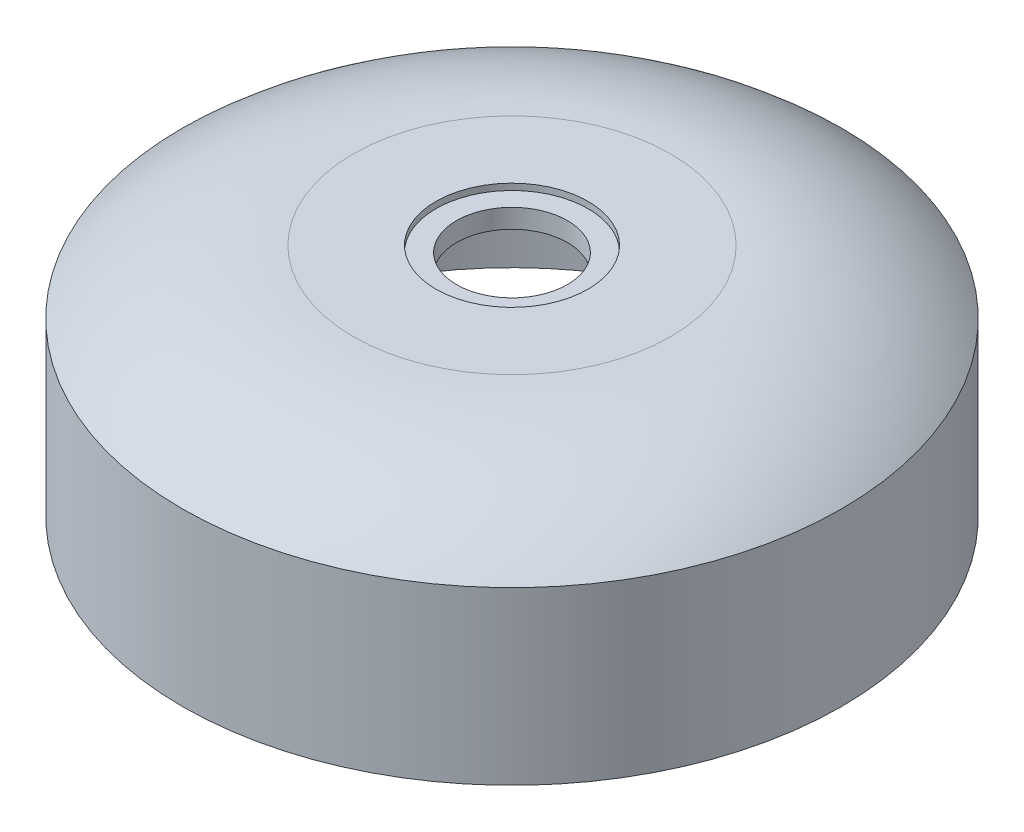
ISO-10303-21;
HEADER;
FILE_DESCRIPTION(('STEP AP214'),'2;1');
FILE_NAME('part.step','',(''),(''),'','','');
FILE_SCHEMA(('AUTOMOTIVE_DESIGN { 1 0 10303 214 1 1 1 1 }'));
ENDSEC;
DATA;
#1=APPLICATION_CONTEXT('core data for automotive mechanical design processes');
#2=APPLICATION_PROTOCOL_DEFINITION('international standard','automotive_design',2000,#1);
#3=PRODUCT_CONTEXT('',#1,'mechanical');
#4=PRODUCT('Part','Part','',(#3));
#5=PRODUCT_RELATED_PRODUCT_CATEGORY('part','',(#4));
#6=PRODUCT_DEFINITION_FORMATION('','',#4);
#7=PRODUCT_DEFINITION_CONTEXT('part definition',#1,'design');
#8=PRODUCT_DEFINITION('design','',#6,#7);
#9=PRODUCT_DEFINITION_SHAPE('','',#8);
#10=(LENGTH_UNIT() NAMED_UNIT(*) SI_UNIT(.MILLI.,.METRE.));
#11=(NAMED_UNIT(*) PLANE_ANGLE_UNIT() SI_UNIT($,.RADIAN.));
#12=(NAMED_UNIT(*) SI_UNIT($,.STERADIAN.) SOLID_ANGLE_UNIT());
#13=UNCERTAINTY_MEASURE_WITH_UNIT(LENGTH_MEASURE(1.E-05),#10,'distance_accuracy_value','');
#14=(GEOMETRIC_REPRESENTATION_CONTEXT(3) GLOBAL_UNCERTAINTY_ASSIGNED_CONTEXT((#13)) GLOBAL_UNIT_ASSIGNED_CONTEXT((#10,
#11,#12)) REPRESENTATION_CONTEXT('',''));
#15=CARTESIAN_POINT('',(0.,0.,0.));
#16=DIRECTION('',(0.,0.,1.));
#17=DIRECTION('',(1.,0.,0.));
#18=AXIS2_PLACEMENT_3D('',#15,#16,#17);
#19=CARTESIAN_POINT('',(0.,1.,0.));
#20=DIRECTION('',(0.,1.,0.));
#21=DIRECTION('',(0.,0.,1.));
#22=AXIS2_PLACEMENT_3D('',#19,#20,#21);
#23=CYLINDRICAL_SURFACE('',#22,4.375);
#24=CARTESIAN_POINT('',(0.,3.,0.));
#25=DIRECTION('',(0.,1.,0.));
#26=DIRECTION('',(0.,0.,1.));
#27=AXIS2_PLACEMENT_3D('',#24,#25,#26);
#28=CIRCLE('',#27,4.375);
#29=CARTESIAN_POINT('',(0.,3.,4.375));
#30=VERTEX_POINT('',#29);
#31=EDGE_CURVE('E82',#30,#30,#28,.T.);
#32=ORIENTED_EDGE('',*,*,#31,.F.);
#33=EDGE_LOOP('',(#32));
#34=FACE_BOUND('',#33,.T.);
#35=CARTESIAN_POINT('',(0.,4.5,0.));
#36=DIRECTION('',(0.,1.,0.));
#37=DIRECTION('',(0.,0.,1.));
#38=AXIS2_PLACEMENT_3D('',#35,#36,#37);
#39=CIRCLE('',#38,4.375);
#40=CARTESIAN_POINT('',(0.,4.5,4.375));
#41=VERTEX_POINT('',#40);
#42=EDGE_CURVE('E45',#41,#41,#39,.F.);
#43=ORIENTED_EDGE('',*,*,#42,.F.);
#44=EDGE_LOOP('',(#43));
#45=FACE_BOUND('',#44,.T.);
#46=ADVANCED_FACE('F41',(#34,#45),#23,.F.);
#47=CARTESIAN_POINT('',(0.,-14.375,0.));
#48=DIRECTION('',(0.,-1.,0.));
#49=DIRECTION('',(0.,0.,-1.));
#50=AXIS2_PLACEMENT_3D('',#47,#48,#49);
#51=DEGENERATE_TOROIDAL_SURFACE('',#50,13.,17.3814505391108,.T.);
#52=CARTESIAN_POINT('',(-2.05943454850463,0.19621219076057,-22.3814512005602));
#53=CARTESIAN_POINT('',(-1.94735802455095,0.134371402028465,-22.487259136886));
#54=CARTESIAN_POINT('',(-1.82607781715217,0.0760668113987537,-22.5854123510526));
#55=CARTESIAN_POINT('',(-1.5667001930387,-0.0307750314765408,-22.7632296226294));
#56=CARTESIAN_POINT('',(-1.42860588928565,-0.0793140873127828,-22.8428970945777));
#57=CARTESIAN_POINT('',(-1.13735307688941,-0.163995941628465,-22.9807414720083));
#58=CARTESIAN_POINT('',(-0.984108771892124,-0.200062244710892,-23.0387859253823));
#59=CARTESIAN_POINT('',(-0.667536386710761,-0.256633700933164,-23.1294086238986));
#60=CARTESIAN_POINT('',(-0.504216128759802,-0.2771507649902,-23.1620063621283));
#61=CARTESIAN_POINT('',(-0.18874234137231,-0.299737880621983,-23.197863384178));
#62=CARTESIAN_POINT('',(-0.0369767801083575,-0.303356576246571,-23.2035859483691));
#63=CARTESIAN_POINT('',(0.265306434128415,-0.296089696747955,-23.1920679422734));
#64=CARTESIAN_POINT('',(0.415824357795731,-0.285207355382269,-23.1748324916657));
#65=CARTESIAN_POINT('',(0.703135402021717,-0.250722352754957,-23.119909992035));
#66=CARTESIAN_POINT('',(0.840233517435311,-0.227822012664228,-23.0833513992038));
#67=CARTESIAN_POINT('',(1.10591546524896,-0.171196871728586,-22.9922546602371));
#68=CARTESIAN_POINT('',(1.23449770550394,-0.137470053596726,-22.9377131633134));
#69=CARTESIAN_POINT('',(1.488980008897,-0.0584024655000056,-22.8085710738749));
#70=CARTESIAN_POINT('',(1.61412479427046,-0.0124355430873811,-22.7328724058282));
#71=CARTESIAN_POINT('',(1.850052038222,0.087564378035964,-22.5660538946529));
#72=CARTESIAN_POINT('',(1.96082780892207,0.141601107744694,-22.4749269157735));
#73=CARTESIAN_POINT('',(2.18078865074186,0.263411592137683,-22.266430460831));
#74=CARTESIAN_POINT('',(2.28770647084811,0.33205405785726,-22.1471773980103));
#75=CARTESIAN_POINT('',(2.48021372326385,0.474330756599312,-21.8952032872505));
#76=CARTESIAN_POINT('',(2.56579116500576,0.547967766496449,-21.7624747264676));
#77=CARTESIAN_POINT('',(2.7245154100547,0.707760837711285,-21.4682633382959));
#78=CARTESIAN_POINT('',(2.79454616565821,0.794289492523027,-21.3052947809788));
#79=CARTESIAN_POINT('',(2.90494041389823,0.967773196104407,-20.9697659508785));
#80=CARTESIAN_POINT('',(2.94529072540192,1.05472841707699,-20.7972014530696));
#81=CARTESIAN_POINT('',(2.99659399584286,1.23159131298276,-20.4359357001578));
#82=CARTESIAN_POINT('',(3.00562878289929,1.32136110894079,-20.2468886943308));
#83=CARTESIAN_POINT('',(2.98759075845205,1.49545525684212,-19.8679454997471));
#84=CARTESIAN_POINT('',(2.96052168762472,1.57978017197386,-19.6780494009953));
#85=CARTESIAN_POINT('',(2.87096254305485,1.73762036636326,-19.3099189029837));
#86=CARTESIAN_POINT('',(2.80968440228521,1.81140243350658,-19.1315068072518));
#87=CARTESIAN_POINT('',(2.65282267436121,1.94921448506181,-18.7863536882708));
#88=CARTESIAN_POINT('',(2.55726022384852,2.01325044348638,-18.6196055495911));
#89=CARTESIAN_POINT('',(2.34327111476732,2.12494495363453,-18.318449484072));
#90=CARTESIAN_POINT('',(2.227508820914,2.17353715626537,-18.1824943904952));
#91=CARTESIAN_POINT('',(1.97166603204633,2.2604728677244,-17.9318398968506));
#92=CARTESIAN_POINT('',(1.83159726850666,2.29882129812124,-17.8171302976452));
#93=CARTESIAN_POINT('',(1.54270253169887,2.36253252168401,-17.6215914447136));
#94=CARTESIAN_POINT('',(1.39532515991023,2.38865447996821,-17.5388642119703));
#95=CARTESIAN_POINT('',(1.087676485898,2.43202482489792,-17.3990205533553));
#96=CARTESIAN_POINT('',(0.927408141189576,2.44927524022269,-17.3418982727153));
#97=CARTESIAN_POINT('',(0.605079399638042,2.47462910884483,-17.2571085676074));
#98=CARTESIAN_POINT('',(0.443313590076823,2.48305245420747,-17.2284132623672));
#99=CARTESIAN_POINT('',(0.117055860294563,2.49202941361278,-17.1978118774118));
#100=CARTESIAN_POINT('',(-0.0474358103289567,2.49258374425057,-17.1959033583469));
#101=CARTESIAN_POINT('',(-0.372506232026529,2.48587250913071,-17.2188103490379));
#102=CARTESIAN_POINT('',(-0.53310819513741,2.47869523691411,-17.2433241226953));
#103=CARTESIAN_POINT('',(-0.847748391868458,2.45653403908781,-17.3177346131452));
#104=CARTESIAN_POINT('',(-1.00178688580412,2.44155042339993,-17.3676303222406));
#105=CARTESIAN_POINT('',(-1.29931446198763,2.40355430494648,-17.4911664972618));
#106=CARTESIAN_POINT('',(-1.44278221964165,2.38052608311388,-17.5648534294461));
#107=CARTESIAN_POINT('',(-1.71500313766852,2.32633385684208,-17.7333437874638));
#108=CARTESIAN_POINT('',(-1.84375594875845,2.29516965934006,-17.8281477143855));
#109=CARTESIAN_POINT('',(-2.08546163967563,2.22418767750594,-18.0374001096801));
#110=CARTESIAN_POINT('',(-2.19810538447062,2.18423053879852,-18.1521578388488));
#111=CARTESIAN_POINT('',(-2.40249249463909,2.09638856910075,-18.3962841437541));
#112=CARTESIAN_POINT('',(-2.49423233626973,2.04850240387069,-18.5256551773463));
#113=CARTESIAN_POINT('',(-2.65886367630612,1.94324202383834,-18.8009672811889));
#114=CARTESIAN_POINT('',(-2.73074235698823,1.88554189323608,-18.9473880967192));
#115=CARTESIAN_POINT('',(-2.84932039444323,1.76342060908691,-19.2474135660646));
#116=CARTESIAN_POINT('',(-2.89601245410286,1.69899751419562,-19.4010202878009));
#117=CARTESIAN_POINT('',(-2.96675077454022,1.55979815518288,-19.7229912200314));
#118=CARTESIAN_POINT('',(-2.98885281023807,1.4846081965046,-19.8916028671859));
#119=CARTESIAN_POINT('',(-3.00460089819919,1.32992694101096,-20.2281960005441));
#120=CARTESIAN_POINT('',(-2.99823284978194,1.25043353203869,-20.3961771332367));
#121=CARTESIAN_POINT('',(-2.95627935267687,1.08253768512971,-20.7413684777178));
#122=CARTESIAN_POINT('',(-2.91832950304052,0.993940902930202,-20.9181985323566));
#123=CARTESIAN_POINT('',(-2.81140119652405,0.816893426334674,-21.2623031139661));
#124=CARTESIAN_POINT('',(-2.74242229516874,0.728442734049534,-21.4295775040182));
#125=CARTESIAN_POINT('',(-2.58249639919445,0.562869703631484,-21.7354758480389));
#126=CARTESIAN_POINT('',(-2.49417553933646,0.485456863261925,-21.8753184670147));
#127=CARTESIAN_POINT('',(-2.29405770102501,0.336019463192258,-22.1403173647928));
#128=CARTESIAN_POINT('',(-2.18227427802276,0.26399182464875,-22.265482058936));
#129=CARTESIAN_POINT('',(-2.05943454850463,0.19621219076057,-22.3814512005602));
#130=B_SPLINE_CURVE_WITH_KNOTS('',3,(#52,#53,#54,#55,#56,#57,#58,#59,#60,#61,#62,#63,#64,#65,
#66,#67,#68,#69,#70,#71,#72,#73,#74,#75,#76,#77,#78,#79,#80,#81,#82,#83,#84,#85,#86,#87,#88,#89,
#90,#91,#92,#93,#94,#95,#96,#97,#98,#99,#100,#101,#102,#103,#104,#105,#106,#107,#108,#109,#110,
#111,#112,#113,#114,#115,#116,#117,#118,#119,#120,#121,#122,#123,#124,#125,#126,#127,#128,#129),
.UNSPECIFIED.,.T.,.F.,(4,2,2,2,2,2,2,2,2,2,2,2,2,2,2,2,2,2,2,2,2,2,2,2,2,2,2,2,2,2,2,2,2,2,2,2,
2,2,4),(0.,0.497710027984592,0.995328049653929,1.4959459812602,1.99618004440372,
2.44953215716146,2.90278318849392,3.33209112594184,3.76147910239058,4.21960082365987,
4.67793501263565,5.19863164635652,5.71962018921495,6.30914246619929,6.89892639316561,
7.52425353372941,8.14951588994966,8.75391674904872,9.35794562711023,9.91016237702276,
10.462113338048,10.9725952638964,11.4829604045261,11.9741127819841,12.4652204321594,
12.9507785977008,13.4363174874316,13.9228104707696,14.4093149994037,14.9041702300864,
15.39910881624,15.9159327629764,16.4329063645656,16.9883588778663,17.5440865264929,
18.1456085933221,18.7471392769198,19.2929610895799,19.8384684184953),.UNSPECIFIED.);
#131=CARTESIAN_POINT('',(-2.05943454850463,0.19621219076057,-22.3814512005602));
#132=VERTEX_POINT('',#131);
#133=EDGE_CURVE('E12',#132,#132,#130,.T.);
#134=ORIENTED_EDGE('',*,*,#133,.F.);
#135=EDGE_LOOP('',(#134));
#136=FACE_BOUND('',#135,.T.);
#137=CARTESIAN_POINT('',(-2.18650556302163,2.18598092765139,18.1459324687646));
#138=CARTESIAN_POINT('',(-2.07652155186065,2.22721474772232,18.0288536583107));
#139=CARTESIAN_POINT('',(-1.95638686679738,2.26435252353792,17.9198722602093));
#140=CARTESIAN_POINT('',(-1.69859506310718,2.3301668569554,17.7218605031923));
#141=CARTESIAN_POINT('',(-1.56093935609993,2.35884409558218,17.6328285386002));
#142=CARTESIAN_POINT('',(-1.27159696480963,2.4077631425832,17.4778673456709));
#143=CARTESIAN_POINT('',(-1.11989474504464,2.42799547135195,17.4119640929792));
#144=CARTESIAN_POINT('',(-0.806913604333441,2.4601508504309,17.3058347855593));
#145=CARTESIAN_POINT('',(-0.645634643129822,2.47207386580887,17.2656088387781));
#146=CARTESIAN_POINT('',(-0.321213512030281,2.48765509539738,17.2128024117915));
#147=CARTESIAN_POINT('',(-0.158156834236946,2.49145790615691,17.1997383721957));
#148=CARTESIAN_POINT('',(0.167902079683214,2.49130265784383,17.2002695419155));
#149=CARTESIAN_POINT('',(0.33090431883806,2.48734514597147,17.2138628715517));
#150=CARTESIAN_POINT('',(0.651110490956552,2.4716469669185,17.2670453028741));
#151=CARTESIAN_POINT('',(0.808345547406439,2.45995774440934,17.3064625628538));
#152=CARTESIAN_POINT('',(1.11372758532192,2.42867433341333,17.4097328247002));
#153=CARTESIAN_POINT('',(1.26187483152552,2.40908037532632,17.4735851143548));
#154=CARTESIAN_POINT('',(1.54584131695074,2.36169625092298,17.6238937113218));
#155=CARTESIAN_POINT('',(1.6815881951544,2.33386155499789,17.7104725277018));
#156=CARTESIAN_POINT('',(1.93634415520972,2.27002858101927,17.9030292210182));
#157=CARTESIAN_POINT('',(2.05535225466156,2.23402982414021,18.0090082357139));
#158=CARTESIAN_POINT('',(2.27653212918197,2.15316918332024,18.2395110963654));
#159=CARTESIAN_POINT('',(2.37823671523676,2.10811704259135,18.3644157223966));
#160=CARTESIAN_POINT('',(2.55934156156526,2.01032603652422,18.6267251179778));
#161=CARTESIAN_POINT('',(2.63873709389588,1.95758554539048,18.764132529079));
#162=CARTESIAN_POINT('',(2.77782332531247,1.84232092232306,19.0549870416486));
#163=CARTESIAN_POINT('',(2.83622982757297,1.77942392062865,19.2088991006982));
#164=CARTESIAN_POINT('',(2.92684769921113,1.64746780646242,19.5216885953488));
#165=CARTESIAN_POINT('',(2.95905005905916,1.57840658365171,19.6805677192503));
#166=CARTESIAN_POINT('',(2.99913625639042,1.42992711011542,20.0121970898368));
#167=CARTESIAN_POINT('',(3.00485698683416,1.35012257046619,20.185035658961));
#168=CARTESIAN_POINT('',(2.98699066546943,1.18724799140196,20.527633070414));
#169=CARTESIAN_POINT('',(2.96339237904031,1.10417671203396,20.6973907068784));
#170=CARTESIAN_POINT('',(2.8850584052613,0.93068488624068,21.0426804800124));
#171=CARTESIAN_POINT('',(2.82809203292023,0.840185719897724,21.2176705614218));
#172=CARTESIAN_POINT('',(2.6827135313461,0.661122729990272,21.555306904538));
#173=CARTESIAN_POINT('',(2.59428255213644,0.572560100408544,21.7179456957441));
#174=CARTESIAN_POINT('',(2.38553105778214,0.399498775479485,22.0289135869299));
#175=CARTESIAN_POINT('',(2.26468391906006,0.315097238791356,22.1769454836319));
#176=CARTESIAN_POINT('',(1.99370497115634,0.15659842166393,22.4498883594876));
#177=CARTESIAN_POINT('',(1.843614519448,0.0824868392058568,22.5748315113507));
#178=CARTESIAN_POINT('',(1.55566610238256,-0.0346325554224723,22.7695603001602));
#179=CARTESIAN_POINT('',(1.42319967838931,-0.0808583750087976,22.8454093303416));
#180=CARTESIAN_POINT('',(1.14533906186134,-0.161701361488117,22.9770079174705));
#181=CARTESIAN_POINT('',(0.999954276574715,-0.196326889555612,23.0327719533217));
#182=CARTESIAN_POINT('',(0.698993928526707,-0.251784870257744,23.1216676825622));
#183=CARTESIAN_POINT('',(0.543369604811525,-0.272545151347659,23.154680981453));
#184=CARTESIAN_POINT('',(0.227570308663605,-0.298295204454274,23.1955838594945));
#185=CARTESIAN_POINT('',(0.0673971755734813,-0.303291261751296,23.2034834516238));
#186=CARTESIAN_POINT('',(-0.237269695523354,-0.297390238503471,23.194128347824));
#187=CARTESIAN_POINT('',(-0.381866131068071,-0.287895535340386,23.1790932777122));
#188=CARTESIAN_POINT('',(-0.666005025927889,-0.256229119784772,23.1286953135262));
#189=CARTESIAN_POINT('',(-0.805547486313048,-0.234057410076313,23.0933324237558));
#190=CARTESIAN_POINT('',(-1.07672662914256,-0.178334065783628,23.0037760306381));
#191=CARTESIAN_POINT('',(-1.20832340917858,-0.144729844315317,22.9494954817917));
#192=CARTESIAN_POINT('',(-1.46034613530934,-0.0680244086963659,22.8243488475233));
#193=CARTESIAN_POINT('',(-1.58076842371432,-0.0249201004036093,22.7534773580265));
#194=CARTESIAN_POINT('',(-1.82094309718966,0.0738861467551388,22.5890502284351));
#195=CARTESIAN_POINT('',(-1.93923075168874,0.130444342797984,22.4938747465265));
#196=CARTESIAN_POINT('',(-2.15843978929303,0.250334306774168,22.2889435441133));
#197=CARTESIAN_POINT('',(-2.25935184190481,0.313669684560363,22.1791800457202));
#198=CARTESIAN_POINT('',(-2.45597629753219,0.454320957574133,21.9310929292444));
#199=CARTESIAN_POINT('',(-2.54887033321121,0.532339548787458,21.790930715773));
#200=CARTESIAN_POINT('',(-2.7095706439826,0.691490301188505,21.4984980373521));
#201=CARTESIAN_POINT('',(-2.77736350441147,0.772624101729627,21.3462211506903));
#202=CARTESIAN_POINT('',(-2.89262358065283,0.944111633222532,21.0163150116762));
#203=CARTESIAN_POINT('',(-2.93719923012889,1.03453669884453,20.8377045340389));
#204=CARTESIAN_POINT('',(-2.99309956035577,1.21316251843519,20.4741925324518));
#205=CARTESIAN_POINT('',(-3.00441390475264,1.30136257251429,20.2892890709351));
#206=CARTESIAN_POINT('',(-2.9924016707668,1.47414077292392,19.9152337156885));
#207=CARTESIAN_POINT('',(-2.96851973248239,1.55863871908919,19.7260610974251));
#208=CARTESIAN_POINT('',(-2.88417317780174,1.71975587809751,19.352581342228));
#209=CARTESIAN_POINT('',(-2.82373569492453,1.79638088536243,19.1682707022608));
#210=CARTESIAN_POINT('',(-2.67783635078707,1.92913115820879,18.8372603089365));
#211=CARTESIAN_POINT('',(-2.59722207558279,1.98661982539168,18.6889631224935));
#212=CARTESIAN_POINT('',(-2.41044381704392,2.09296171461807,18.405997941366));
#213=CARTESIAN_POINT('',(-2.30429607604282,2.14182039223621,18.2713213594015));
#214=CARTESIAN_POINT('',(-2.18650556302163,2.18598092765139,18.1459324687646));
#215=B_SPLINE_CURVE_WITH_KNOTS('',3,(#137,#138,#139,#140,#141,#142,#143,#144,#145,#146,#147,
#148,#149,#150,#151,#152,#153,#154,#155,#156,#157,#158,#159,#160,#161,#162,#163,#164,#165,#166,
#167,#168,#169,#170,#171,#172,#173,#174,#175,#176,#177,#178,#179,#180,#181,#182,#183,#184,#185,
#186,#187,#188,#189,#190,#191,#192,#193,#194,#195,#196,#197,#198,#199,#200,#201,#202,#203,#204,
#205,#206,#207,#208,#209,#210,#211,#212,#213,#214),.UNSPECIFIED.,.T.,.F.,(4,2,2,2,2,2,2,2,2,2,2,
2,2,2,2,2,2,2,2,2,2,2,2,2,2,2,2,2,2,2,2,2,2,2,2,2,2,2,4),(0.,0.496939652235446,
0.993839292747633,1.49129522414138,1.98875324682078,2.47727650273788,2.96576531286541,
3.45103611573569,3.93629277540872,4.42422097230511,4.91217779379521,5.41172789226232,
5.91138378034049,6.43781976440733,6.96443667173813,7.5333888763996,8.10255916252218,
8.71499767512051,9.32780370997464,9.95124107570769,10.5738030600346,11.0503041880898,
11.5264611244571,12.0050776333858,12.4835032912246,12.9184728573338,13.353442331348,
13.7904402387851,14.2275806856606,14.7117315990663,15.1961416904535,15.7499825063151,
16.3041188820878,16.9165991340747,17.5292697016182,18.1517116433036,18.7736921406282,
19.3062417051684,19.8384533962996),.UNSPECIFIED.);
#216=CARTESIAN_POINT('',(-2.18650556302163,2.18598092765139,18.1459324687646));
#217=VERTEX_POINT('',#216);
#218=EDGE_CURVE('E50',#217,#217,#215,.T.);
#219=ORIENTED_EDGE('',*,*,#218,.F.);
#220=EDGE_LOOP('',(#219));
#221=FACE_BOUND('',#220,.T.);
#222=CARTESIAN_POINT('',(0.,-0.917109272120071,0.));
#223=DIRECTION('',(0.,-1.,0.));
#224=DIRECTION('',(0.,0.,-1.));
#225=AXIS2_PLACEMENT_3D('',#222,#223,#224);
#226=CIRCLE('',#225,24.);
#227=CARTESIAN_POINT('',(0.,-0.917109272120071,-24.));
#228=VERTEX_POINT('',#227);
#229=EDGE_CURVE('E177',#228,#228,#226,.T.);
#230=ORIENTED_EDGE('',*,*,#229,.T.);
#231=EDGE_LOOP('',(#230));
#232=FACE_BOUND('',#231,.T.);
#233=CARTESIAN_POINT('',(0.,3.,0.));
#234=DIRECTION('',(0.,-1.,0.));
#235=DIRECTION('',(0.,0.,-1.));
#236=AXIS2_PLACEMENT_3D('',#233,#234,#235);
#237=CIRCLE('',#236,12.5265046530783);
#238=CARTESIAN_POINT('',(0.,3.,-12.5265046530783));
#239=VERTEX_POINT('',#238);
#240=EDGE_CURVE('E179',#239,#239,#237,.T.);
#241=ORIENTED_EDGE('',*,*,#240,.F.);
#242=EDGE_LOOP('',(#241));
#243=FACE_BOUND('',#242,.T.);
#244=ADVANCED_FACE('F118',(#136,#221,#232,#243),#51,.F.);
#245=CARTESIAN_POINT('',(0.,3.,0.));
#246=DIRECTION('',(0.,1.,0.));
#247=DIRECTION('',(0.,0.,1.));
#248=AXIS2_PLACEMENT_3D('',#245,#246,#247);
#249=PLANE('',#248);
#250=ORIENTED_EDGE('',*,*,#31,.T.);
#251=EDGE_LOOP('',(#250));
#252=FACE_BOUND('',#251,.T.);
#253=ORIENTED_EDGE('',*,*,#240,.T.);
#254=EDGE_LOOP('',(#253));
#255=FACE_BOUND('',#254,.T.);
#256=ADVANCED_FACE('F121',(#252,#255),#249,.F.);
#257=CARTESIAN_POINT('',(0.,-13.5,0.));
#258=DIRECTION('',(0.,1.,0.));
#259=DIRECTION('',(0.,0.,1.));
#260=AXIS2_PLACEMENT_3D('',#257,#258,#259);
#261=CYLINDRICAL_SURFACE('',#260,24.);
#262=CARTESIAN_POINT('',(0.,-13.5,0.));
#263=DIRECTION('',(0.,-1.,0.));
#264=DIRECTION('',(0.,0.,-1.));
#265=AXIS2_PLACEMENT_3D('',#262,#263,#264);
#266=CIRCLE('',#265,24.);
#267=CARTESIAN_POINT('',(0.,-13.5,-24.));
#268=VERTEX_POINT('',#267);
#269=EDGE_CURVE('E85',#268,#268,#266,.T.);
#270=ORIENTED_EDGE('',*,*,#269,.T.);
#271=EDGE_LOOP('',(#270));
#272=FACE_BOUND('',#271,.T.);
#273=ORIENTED_EDGE('',*,*,#229,.F.);
#274=EDGE_LOOP('',(#273));
#275=FACE_BOUND('',#274,.T.);
#276=ADVANCED_FACE('F43',(#272,#275),#261,.F.);
#277=CARTESIAN_POINT('',(0.,-14.375,0.));
#278=DIRECTION('',(0.,-1.,0.));
#279=DIRECTION('',(0.,0.,-1.));
#280=AXIS2_PLACEMENT_3D('',#277,#278,#279);
#281=DEGENERATE_TOROIDAL_SURFACE('',#280,13.,19.3814505391108,.T.);
#282=CARTESIAN_POINT('',(0.,0.,0.));
#283=DIRECTION('',(0.,-1.,0.));
#284=DIRECTION('',(0.,0.,-1.));
#285=AXIS2_PLACEMENT_3D('',#282,#283,#284);
#286=CIRCLE('',#285,26.);
#287=CARTESIAN_POINT('',(0.,0.,-26.));
#288=VERTEX_POINT('',#287);
#289=EDGE_CURVE('E88',#288,#288,#286,.T.);
#290=ORIENTED_EDGE('',*,*,#289,.F.);
#291=EDGE_LOOP('',(#290));
#292=FACE_BOUND('',#291,.T.);
#293=CARTESIAN_POINT('',(0.,5.,0.));
#294=DIRECTION('',(0.,-1.,0.));
#295=DIRECTION('',(0.,0.,-1.));
#296=AXIS2_PLACEMENT_3D('',#293,#294,#295);
#297=CIRCLE('',#296,12.5);
#298=CARTESIAN_POINT('',(0.,5.,-12.5));
#299=VERTEX_POINT('',#298);
#300=EDGE_CURVE('E92',#299,#299,#297,.T.);
#301=ORIENTED_EDGE('',*,*,#300,.T.);
#302=EDGE_LOOP('',(#301));
#303=FACE_BOUND('',#302,.T.);
#304=ADVANCED_FACE('F114',(#292,#303),#281,.T.);
#305=CARTESIAN_POINT('',(0.,5.,0.));
#306=DIRECTION('',(0.,1.,0.));
#307=DIRECTION('',(0.,0.,1.));
#308=AXIS2_PLACEMENT_3D('',#305,#306,#307);
#309=PLANE('',#308);
#310=CARTESIAN_POINT('',(0.,5.,0.));
#311=DIRECTION('',(0.,1.,0.));
#312=DIRECTION('',(0.,0.,1.));
#313=AXIS2_PLACEMENT_3D('',#310,#311,#312);
#314=CIRCLE('',#313,6.);
#315=CARTESIAN_POINT('',(0.,5.,6.));
#316=VERTEX_POINT('',#315);
#317=EDGE_CURVE('E234',#316,#316,#314,.T.);
#318=ORIENTED_EDGE('',*,*,#317,.F.);
#319=EDGE_LOOP('',(#318));
#320=FACE_BOUND('',#319,.T.);
#321=ORIENTED_EDGE('',*,*,#300,.F.);
#322=EDGE_LOOP('',(#321));
#323=FACE_BOUND('',#322,.T.);
#324=ADVANCED_FACE('F103',(#320,#323),#309,.T.);
#325=CARTESIAN_POINT('',(0.,-13.5,0.));
#326=DIRECTION('',(0.,1.,0.));
#327=DIRECTION('',(0.,0.,1.));
#328=AXIS2_PLACEMENT_3D('',#325,#326,#327);
#329=CYLINDRICAL_SURFACE('',#328,26.);
#330=CARTESIAN_POINT('',(0.,-13.5,0.));
#331=DIRECTION('',(0.,-1.,0.));
#332=DIRECTION('',(0.,0.,-1.));
#333=AXIS2_PLACEMENT_3D('',#330,#331,#332);
#334=CIRCLE('',#333,26.);
#335=CARTESIAN_POINT('',(0.,-13.5,-26.));
#336=VERTEX_POINT('',#335);
#337=EDGE_CURVE('E89',#336,#336,#334,.T.);
#338=ORIENTED_EDGE('',*,*,#337,.F.);
#339=EDGE_LOOP('',(#338));
#340=FACE_BOUND('',#339,.T.);
#341=ORIENTED_EDGE('',*,*,#289,.T.);
#342=EDGE_LOOP('',(#341));
#343=FACE_BOUND('',#342,.T.);
#344=ADVANCED_FACE('F113',(#340,#343),#329,.T.);
#345=CARTESIAN_POINT('',(0.,-13.5,0.));
#346=DIRECTION('',(0.,-1.,0.));
#347=DIRECTION('',(0.,0.,-1.));
#348=AXIS2_PLACEMENT_3D('',#345,#346,#347);
#349=PLANE('',#348);
#350=ORIENTED_EDGE('',*,*,#269,.F.);
#351=EDGE_LOOP('',(#350));
#352=FACE_BOUND('',#351,.T.);
#353=ORIENTED_EDGE('',*,*,#337,.T.);
#354=EDGE_LOOP('',(#353));
#355=FACE_BOUND('',#354,.T.);
#356=ADVANCED_FACE('F152',(#352,#355),#349,.T.);
#357=CARTESIAN_POINT('',(0.,-1.65,20.2));
#358=DIRECTION('',(0.,1.,0.));
#359=DIRECTION('',(0.,0.,1.));
#360=AXIS2_PLACEMENT_3D('',#357,#358,#359);
#361=CYLINDRICAL_SURFACE('',#360,3.);
#362=ORIENTED_EDGE('',*,*,#218,.T.);
#363=EDGE_LOOP('',(#362));
#364=FACE_BOUND('',#363,.T.);
#365=CARTESIAN_POINT('',(0.,-3.25,20.2));
#366=DIRECTION('',(0.,-1.,0.));
#367=DIRECTION('',(0.,0.,1.));
#368=AXIS2_PLACEMENT_3D('',#365,#366,#367);
#369=CIRCLE('',#368,3.);
#370=CARTESIAN_POINT('',(0.,-3.25,23.2));
#371=VERTEX_POINT('',#370);
#372=EDGE_CURVE('E242',#371,#371,#369,.T.);
#373=ORIENTED_EDGE('',*,*,#372,.F.);
#374=EDGE_LOOP('',(#373));
#375=FACE_BOUND('',#374,.T.);
#376=ADVANCED_FACE('F140',(#364,#375),#361,.T.);
#377=CARTESIAN_POINT('',(0.,-1.65,-20.2));
#378=DIRECTION('',(0.,1.,0.));
#379=DIRECTION('',(0.,0.,1.));
#380=AXIS2_PLACEMENT_3D('',#377,#378,#379);
#381=CYLINDRICAL_SURFACE('',#380,3.);
#382=ORIENTED_EDGE('',*,*,#133,.T.);
#383=EDGE_LOOP('',(#382));
#384=FACE_BOUND('',#383,.T.);
#385=CARTESIAN_POINT('',(0.,-3.25,-20.2));
#386=DIRECTION('',(0.,-1.,0.));
#387=DIRECTION('',(0.,0.,-1.));
#388=AXIS2_PLACEMENT_3D('',#385,#386,#387);
#389=CIRCLE('',#388,3.);
#390=CARTESIAN_POINT('',(0.,-3.25,-23.2));
#391=VERTEX_POINT('',#390);
#392=EDGE_CURVE('E250',#391,#391,#389,.T.);
#393=ORIENTED_EDGE('',*,*,#392,.F.);
#394=EDGE_LOOP('',(#393));
#395=FACE_BOUND('',#394,.T.);
#396=ADVANCED_FACE('F134',(#384,#395),#381,.T.);
#397=CARTESIAN_POINT('',(0.,-3.25,-20.2));
#398=DIRECTION('',(0.,-1.,0.));
#399=DIRECTION('',(0.,0.,-1.));
#400=AXIS2_PLACEMENT_3D('',#397,#398,#399);
#401=PLANE('',#400);
#402=ORIENTED_EDGE('',*,*,#392,.T.);
#403=EDGE_LOOP('',(#402));
#404=FACE_BOUND('',#403,.T.);
#405=CARTESIAN_POINT('',(0.,-3.25,-20.2));
#406=DIRECTION('',(0.,-1.,0.));
#407=DIRECTION('',(0.,0.,-1.));
#408=AXIS2_PLACEMENT_3D('',#405,#406,#407);
#409=CIRCLE('',#408,2.);
#410=CARTESIAN_POINT('',(0.,-3.25,-22.2));
#411=VERTEX_POINT('',#410);
#412=EDGE_CURVE('E247',#411,#411,#409,.T.);
#413=ORIENTED_EDGE('',*,*,#412,.F.);
#414=EDGE_LOOP('',(#413));
#415=FACE_BOUND('',#414,.T.);
#416=ADVANCED_FACE('F139',(#404,#415),#401,.T.);
#417=CARTESIAN_POINT('',(0.,-3.25,-20.2));
#418=DIRECTION('',(0.,1.,0.));
#419=DIRECTION('',(0.,0.,1.));
#420=AXIS2_PLACEMENT_3D('',#417,#418,#419);
#421=CYLINDRICAL_SURFACE('',#420,2.);
#422=ORIENTED_EDGE('',*,*,#412,.T.);
#423=EDGE_LOOP('',(#422));
#424=FACE_BOUND('',#423,.T.);
#425=CARTESIAN_POINT('',(0.,-1.65,-20.2));
#426=DIRECTION('',(0.,-1.,0.));
#427=DIRECTION('',(0.,0.,-1.));
#428=AXIS2_PLACEMENT_3D('',#425,#426,#427);
#429=CIRCLE('',#428,2.);
#430=CARTESIAN_POINT('',(0.,-1.65,-22.2));
#431=VERTEX_POINT('',#430);
#432=EDGE_CURVE('E246',#431,#431,#429,.T.);
#433=ORIENTED_EDGE('',*,*,#432,.F.);
#434=EDGE_LOOP('',(#433));
#435=FACE_BOUND('',#434,.T.);
#436=ADVANCED_FACE('F273',(#424,#435),#421,.F.);
#437=CARTESIAN_POINT('',(0.,2.35,-20.2));
#438=DIRECTION('',(0.,-1.,0.));
#439=DIRECTION('',(0.,0.,-1.));
#440=AXIS2_PLACEMENT_3D('',#437,#438,#439);
#441=CONICAL_SURFACE('',#440,1.25,1.02974425867665);
#442=CARTESIAN_POINT('',(0.,3.10107577378445,-20.2));
#443=VERTEX_POINT('',#442);
#444=VERTEX_LOOP('',#443);
#445=FACE_BOUND('',#444,.T.);
#446=CARTESIAN_POINT('',(0.,2.35,-20.2));
#447=DIRECTION('',(0.,-1.,0.));
#448=DIRECTION('',(0.,0.,-1.));
#449=AXIS2_PLACEMENT_3D('',#446,#447,#448);
#450=CIRCLE('',#449,1.25);
#451=CARTESIAN_POINT('',(0.,2.35,-21.45));
#452=VERTEX_POINT('',#451);
#453=EDGE_CURVE('E79',#452,#452,#450,.T.);
#454=ORIENTED_EDGE('',*,*,#453,.T.);
#455=EDGE_LOOP('',(#454));
#456=FACE_BOUND('',#455,.T.);
#457=ADVANCED_FACE('F276',(#445,#456),#441,.F.);
#458=CARTESIAN_POINT('',(0.,-1.65,-20.2));
#459=DIRECTION('',(0.,-1.,0.));
#460=DIRECTION('',(0.,0.,-1.));
#461=AXIS2_PLACEMENT_3D('',#458,#459,#460);
#462=CYLINDRICAL_SURFACE('',#461,1.25);
#463=ORIENTED_EDGE('',*,*,#453,.F.);
#464=EDGE_LOOP('',(#463));
#465=FACE_BOUND('',#464,.T.);
#466=CARTESIAN_POINT('',(0.,-1.375,-20.2));
#467=DIRECTION('',(0.,-1.,0.));
#468=DIRECTION('',(0.,0.,-1.));
#469=AXIS2_PLACEMENT_3D('',#466,#467,#468);
#470=CIRCLE('',#469,1.25);
#471=CARTESIAN_POINT('',(0.,-1.375,-21.45));
#472=VERTEX_POINT('',#471);
#473=EDGE_CURVE('E70',#472,#472,#470,.T.);
#474=ORIENTED_EDGE('',*,*,#473,.T.);
#475=EDGE_LOOP('',(#474));
#476=FACE_BOUND('',#475,.T.);
#477=ADVANCED_FACE('F289',(#465,#476),#462,.F.);
#478=CARTESIAN_POINT('',(0.,-1.65,-20.2));
#479=DIRECTION('',(0.,-1.,0.));
#480=DIRECTION('',(0.,0.,-1.));
#481=AXIS2_PLACEMENT_3D('',#478,#479,#480);
#482=CONICAL_SURFACE('',#481,1.525,0.78539816339745);
#483=ORIENTED_EDGE('',*,*,#473,.F.);
#484=EDGE_LOOP('',(#483));
#485=FACE_BOUND('',#484,.T.);
#486=CARTESIAN_POINT('',(0.,-1.65,-20.2));
#487=DIRECTION('',(0.,-1.,0.));
#488=DIRECTION('',(0.,0.,-1.));
#489=AXIS2_PLACEMENT_3D('',#486,#487,#488);
#490=CIRCLE('',#489,1.525);
#491=CARTESIAN_POINT('',(0.,-1.65,-21.725));
#492=VERTEX_POINT('',#491);
#493=EDGE_CURVE('E66',#492,#492,#490,.T.);
#494=ORIENTED_EDGE('',*,*,#493,.T.);
#495=EDGE_LOOP('',(#494));
#496=FACE_BOUND('',#495,.T.);
#497=ADVANCED_FACE('F286',(#485,#496),#482,.F.);
#498=CARTESIAN_POINT('',(0.,-1.65,-20.2));
#499=DIRECTION('',(0.,-1.,0.));
#500=DIRECTION('',(0.,0.,-1.));
#501=AXIS2_PLACEMENT_3D('',#498,#499,#500);
#502=PLANE('',#501);
#503=ORIENTED_EDGE('',*,*,#493,.F.);
#504=EDGE_LOOP('',(#503));
#505=FACE_BOUND('',#504,.T.);
#506=ORIENTED_EDGE('',*,*,#432,.T.);
#507=EDGE_LOOP('',(#506));
#508=FACE_BOUND('',#507,.T.);
#509=ADVANCED_FACE('F142',(#505,#508),#502,.T.);
#510=CARTESIAN_POINT('',(0.,-3.25,20.2));
#511=DIRECTION('',(0.,1.,0.));
#512=DIRECTION('',(0.,0.,1.));
#513=AXIS2_PLACEMENT_3D('',#510,#511,#512);
#514=PLANE('',#513);
#515=ORIENTED_EDGE('',*,*,#372,.T.);
#516=EDGE_LOOP('',(#515));
#517=FACE_BOUND('',#516,.T.);
#518=CARTESIAN_POINT('',(0.,-3.25,20.2));
#519=DIRECTION('',(0.,-1.,0.));
#520=DIRECTION('',(0.,0.,1.));
#521=AXIS2_PLACEMENT_3D('',#518,#519,#520);
#522=CIRCLE('',#521,2.);
#523=CARTESIAN_POINT('',(0.,-3.25,22.2));
#524=VERTEX_POINT('',#523);
#525=EDGE_CURVE('E231',#524,#524,#522,.T.);
#526=ORIENTED_EDGE('',*,*,#525,.F.);
#527=EDGE_LOOP('',(#526));
#528=FACE_BOUND('',#527,.T.);
#529=ADVANCED_FACE('F261',(#517,#528),#514,.F.);
#530=CARTESIAN_POINT('',(0.,-3.25,20.2));
#531=DIRECTION('',(0.,1.,0.));
#532=DIRECTION('',(0.,0.,1.));
#533=AXIS2_PLACEMENT_3D('',#530,#531,#532);
#534=CYLINDRICAL_SURFACE('',#533,2.);
#535=ORIENTED_EDGE('',*,*,#525,.T.);
#536=EDGE_LOOP('',(#535));
#537=FACE_BOUND('',#536,.T.);
#538=CARTESIAN_POINT('',(0.,-1.65,20.2));
#539=DIRECTION('',(0.,-1.,0.));
#540=DIRECTION('',(0.,0.,1.));
#541=AXIS2_PLACEMENT_3D('',#538,#539,#540);
#542=CIRCLE('',#541,2.);
#543=CARTESIAN_POINT('',(0.,-1.65,22.2));
#544=VERTEX_POINT('',#543);
#545=EDGE_CURVE('E228',#544,#544,#542,.T.);
#546=ORIENTED_EDGE('',*,*,#545,.F.);
#547=EDGE_LOOP('',(#546));
#548=FACE_BOUND('',#547,.T.);
#549=ADVANCED_FACE('F60',(#537,#548),#534,.F.);
#550=CARTESIAN_POINT('',(0.,2.35,20.2));
#551=DIRECTION('',(0.,-1.,0.));
#552=DIRECTION('',(0.,0.,-1.));
#553=AXIS2_PLACEMENT_3D('',#550,#551,#552);
#554=CONICAL_SURFACE('',#553,1.25,1.02974425867665);
#555=CARTESIAN_POINT('',(0.,3.10107577378445,20.2));
#556=VERTEX_POINT('',#555);
#557=VERTEX_LOOP('',#556);
#558=FACE_BOUND('',#557,.T.);
#559=CARTESIAN_POINT('',(0.,2.35,20.2));
#560=DIRECTION('',(0.,-1.,0.));
#561=DIRECTION('',(0.,0.,-1.));
#562=AXIS2_PLACEMENT_3D('',#559,#560,#561);
#563=CIRCLE('',#562,1.25);
#564=CARTESIAN_POINT('',(0.,2.35,18.95));
#565=VERTEX_POINT('',#564);
#566=EDGE_CURVE('E64',#565,#565,#563,.T.);
#567=ORIENTED_EDGE('',*,*,#566,.T.);
#568=EDGE_LOOP('',(#567));
#569=FACE_BOUND('',#568,.T.);
#570=ADVANCED_FACE('F56',(#558,#569),#554,.F.);
#571=CARTESIAN_POINT('',(0.,-1.65,20.2));
#572=DIRECTION('',(0.,-1.,0.));
#573=DIRECTION('',(0.,0.,-1.));
#574=AXIS2_PLACEMENT_3D('',#571,#572,#573);
#575=CYLINDRICAL_SURFACE('',#574,1.25);
#576=ORIENTED_EDGE('',*,*,#566,.F.);
#577=EDGE_LOOP('',(#576));
#578=FACE_BOUND('',#577,.T.);
#579=CARTESIAN_POINT('',(0.,-1.375,20.2));
#580=DIRECTION('',(0.,-1.,0.));
#581=DIRECTION('',(0.,0.,-1.));
#582=AXIS2_PLACEMENT_3D('',#579,#580,#581);
#583=CIRCLE('',#582,1.25);
#584=CARTESIAN_POINT('',(0.,-1.375,18.95));
#585=VERTEX_POINT('',#584);
#586=EDGE_CURVE('E67',#585,#585,#583,.T.);
#587=ORIENTED_EDGE('',*,*,#586,.T.);
#588=EDGE_LOOP('',(#587));
#589=FACE_BOUND('',#588,.T.);
#590=ADVANCED_FACE('F59',(#578,#589),#575,.F.);
#591=CARTESIAN_POINT('',(0.,-1.65,20.2));
#592=DIRECTION('',(0.,-1.,0.));
#593=DIRECTION('',(0.,0.,-1.));
#594=AXIS2_PLACEMENT_3D('',#591,#592,#593);
#595=CONICAL_SURFACE('',#594,1.525,0.78539816339745);
#596=ORIENTED_EDGE('',*,*,#586,.F.);
#597=EDGE_LOOP('',(#596));
#598=FACE_BOUND('',#597,.T.);
#599=CARTESIAN_POINT('',(0.,-1.65,20.2));
#600=DIRECTION('',(0.,-1.,0.));
#601=DIRECTION('',(0.,0.,-1.));
#602=AXIS2_PLACEMENT_3D('',#599,#600,#601);
#603=CIRCLE('',#602,1.525);
#604=CARTESIAN_POINT('',(0.,-1.65,18.675));
#605=VERTEX_POINT('',#604);
#606=EDGE_CURVE('E73',#605,#605,#603,.T.);
#607=ORIENTED_EDGE('',*,*,#606,.T.);
#608=EDGE_LOOP('',(#607));
#609=FACE_BOUND('',#608,.T.);
#610=ADVANCED_FACE('F147',(#598,#609),#595,.F.);
#611=CARTESIAN_POINT('',(0.,-1.65,20.2));
#612=DIRECTION('',(0.,1.,0.));
#613=DIRECTION('',(0.,0.,1.));
#614=AXIS2_PLACEMENT_3D('',#611,#612,#613);
#615=PLANE('',#614);
#616=ORIENTED_EDGE('',*,*,#606,.F.);
#617=EDGE_LOOP('',(#616));
#618=FACE_BOUND('',#617,.T.);
#619=ORIENTED_EDGE('',*,*,#545,.T.);
#620=EDGE_LOOP('',(#619));
#621=FACE_BOUND('',#620,.T.);
#622=ADVANCED_FACE('F144',(#618,#621),#615,.F.);
#623=CARTESIAN_POINT('',(0.,4.5,0.));
#624=DIRECTION('',(0.,1.,0.));
#625=DIRECTION('',(0.,0.,1.));
#626=AXIS2_PLACEMENT_3D('',#623,#624,#625);
#627=PLANE('',#626);
#628=CARTESIAN_POINT('',(0.,4.5,0.));
#629=DIRECTION('',(0.,1.,0.));
#630=DIRECTION('',(0.,0.,1.));
#631=AXIS2_PLACEMENT_3D('',#628,#629,#630);
#632=CIRCLE('',#631,6.);
#633=CARTESIAN_POINT('',(0.,4.5,6.));
#634=VERTEX_POINT('',#633);
#635=EDGE_CURVE('E229',#634,#634,#632,.T.);
#636=ORIENTED_EDGE('',*,*,#635,.T.);
#637=EDGE_LOOP('',(#636));
#638=FACE_BOUND('',#637,.T.);
#639=ORIENTED_EDGE('',*,*,#42,.T.);
#640=EDGE_LOOP('',(#639));
#641=FACE_BOUND('',#640,.T.);
#642=ADVANCED_FACE('F146',(#638,#641),#627,.T.);
#643=CARTESIAN_POINT('',(0.,4.5,0.));
#644=DIRECTION('',(0.,1.,0.));
#645=DIRECTION('',(0.,0.,1.));
#646=AXIS2_PLACEMENT_3D('',#643,#644,#645);
#647=CYLINDRICAL_SURFACE('',#646,6.);
#648=ORIENTED_EDGE('',*,*,#635,.F.);
#649=EDGE_LOOP('',(#648));
#650=FACE_BOUND('',#649,.T.);
#651=ORIENTED_EDGE('',*,*,#317,.T.);
#652=EDGE_LOOP('',(#651));
#653=FACE_BOUND('',#652,.T.);
#654=ADVANCED_FACE('F270',(#650,#653),#647,.F.);
#655=CLOSED_SHELL('',(#46,#244,#256,#276,#304,#324,#344,#356,#376,#396,#416,#436,#457,#477,#497,
#509,#529,#549,#570,#590,#610,#622,#642,#654));
#656=MANIFOLD_SOLID_BREP('B2',#655);
#657=ADVANCED_BREP_SHAPE_REPRESENTATION('',(#18,#656),#14);
#658=SHAPE_DEFINITION_REPRESENTATION(#9,#657);
ENDSEC;
END-ISO-10303-21;
